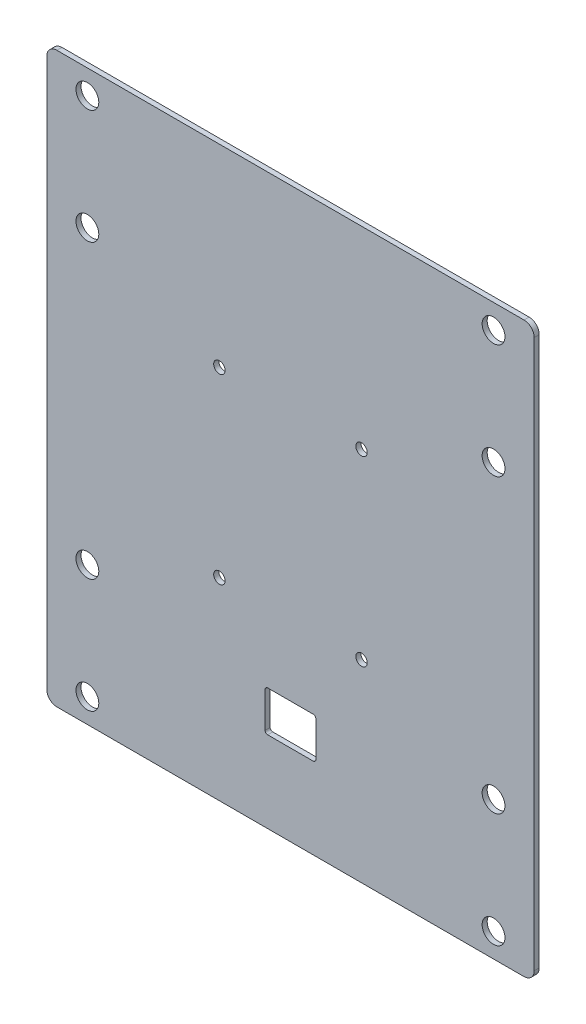
ISO-10303-21;
HEADER;
FILE_DESCRIPTION(('STEP AP214'),'2;1');
FILE_NAME('part.step','',(''),(''),'','','');
FILE_SCHEMA(('AUTOMOTIVE_DESIGN { 1 0 10303 214 1 1 1 1 }'));
ENDSEC;
DATA;
#1=APPLICATION_CONTEXT('core data for automotive mechanical design processes');
#2=APPLICATION_PROTOCOL_DEFINITION('international standard','automotive_design',2000,#1);
#3=PRODUCT_CONTEXT('',#1,'mechanical');
#4=PRODUCT('Part','Part','',(#3));
#5=PRODUCT_RELATED_PRODUCT_CATEGORY('part','',(#4));
#6=PRODUCT_DEFINITION_FORMATION('','',#4);
#7=PRODUCT_DEFINITION_CONTEXT('part definition',#1,'design');
#8=PRODUCT_DEFINITION('design','',#6,#7);
#9=PRODUCT_DEFINITION_SHAPE('','',#8);
#10=(LENGTH_UNIT() NAMED_UNIT(*) SI_UNIT(.MILLI.,.METRE.));
#11=(NAMED_UNIT(*) PLANE_ANGLE_UNIT() SI_UNIT($,.RADIAN.));
#12=(NAMED_UNIT(*) SI_UNIT($,.STERADIAN.) SOLID_ANGLE_UNIT());
#13=UNCERTAINTY_MEASURE_WITH_UNIT(LENGTH_MEASURE(1.E-05),#10,'distance_accuracy_value','');
#14=(GEOMETRIC_REPRESENTATION_CONTEXT(3) GLOBAL_UNCERTAINTY_ASSIGNED_CONTEXT((#13)) GLOBAL_UNIT_ASSIGNED_CONTEXT((#10,
#11,#12)) REPRESENTATION_CONTEXT('',''));
#15=CARTESIAN_POINT('',(0.,0.,0.));
#16=DIRECTION('',(0.,0.,1.));
#17=DIRECTION('',(1.,0.,0.));
#18=AXIS2_PLACEMENT_3D('',#15,#16,#17);
#19=CARTESIAN_POINT('',(152.4,177.8,3.175));
#20=DIRECTION('',(-1.,0.,0.));
#21=DIRECTION('',(0.,-1.,0.));
#22=AXIS2_PLACEMENT_3D('',#19,#20,#21);
#23=PLANE('',#22);
#24=DIRECTION('',(0.,1.,0.));
#25=VECTOR('',#24,1.);
#26=CARTESIAN_POINT('',(152.4,177.8,3.175));
#27=LINE('',#26,#25);
#28=CARTESIAN_POINT('',(152.4,-171.45,3.175));
#29=VERTEX_POINT('',#28);
#30=CARTESIAN_POINT('',(152.4,171.45,3.175));
#31=VERTEX_POINT('',#30);
#32=EDGE_CURVE('E165',#29,#31,#27,.T.);
#33=ORIENTED_EDGE('',*,*,#32,.F.);
#34=DIRECTION('',(0.,0.,-1.));
#35=VECTOR('',#34,1.);
#36=CARTESIAN_POINT('',(152.4,-171.45,3.175));
#37=LINE('',#36,#35);
#38=CARTESIAN_POINT('',(152.4,-171.45,0.));
#39=VERTEX_POINT('',#38);
#40=EDGE_CURVE('E150',#29,#39,#37,.T.);
#41=ORIENTED_EDGE('',*,*,#40,.T.);
#42=DIRECTION('',(0.,1.,0.));
#43=VECTOR('',#42,1.);
#44=CARTESIAN_POINT('',(152.4,177.8,0.));
#45=LINE('',#44,#43);
#46=CARTESIAN_POINT('',(152.4,171.45,0.));
#47=VERTEX_POINT('',#46);
#48=EDGE_CURVE('E162',#39,#47,#45,.T.);
#49=ORIENTED_EDGE('',*,*,#48,.T.);
#50=DIRECTION('',(0.,0.,-1.));
#51=VECTOR('',#50,1.);
#52=CARTESIAN_POINT('',(152.4,171.45,3.175));
#53=LINE('',#52,#51);
#54=EDGE_CURVE('E167',#47,#31,#53,.F.);
#55=ORIENTED_EDGE('',*,*,#54,.T.);
#56=EDGE_LOOP('',(#33,#41,#49,#55));
#57=FACE_BOUND('',#56,.T.);
#58=ADVANCED_FACE('F33',(#57),#23,.F.);
#59=CARTESIAN_POINT('',(-152.4,177.8,3.175));
#60=DIRECTION('',(0.,-1.,0.));
#61=DIRECTION('',(0.,0.,-1.));
#62=AXIS2_PLACEMENT_3D('',#59,#60,#61);
#63=PLANE('',#62);
#64=DIRECTION('',(-1.,0.,0.));
#65=VECTOR('',#64,1.);
#66=CARTESIAN_POINT('',(-152.4,177.8,3.175));
#67=LINE('',#66,#65);
#68=CARTESIAN_POINT('',(146.05,177.8,3.175));
#69=VERTEX_POINT('',#68);
#70=CARTESIAN_POINT('',(-146.05,177.8,3.175));
#71=VERTEX_POINT('',#70);
#72=EDGE_CURVE('E349',#69,#71,#67,.T.);
#73=ORIENTED_EDGE('',*,*,#72,.F.);
#74=DIRECTION('',(0.,0.,-1.));
#75=VECTOR('',#74,1.);
#76=CARTESIAN_POINT('',(146.05,177.8,3.175));
#77=LINE('',#76,#75);
#78=CARTESIAN_POINT('',(146.05,177.8,0.));
#79=VERTEX_POINT('',#78);
#80=EDGE_CURVE('E211',#69,#79,#77,.T.);
#81=ORIENTED_EDGE('',*,*,#80,.T.);
#82=DIRECTION('',(-1.,0.,0.));
#83=VECTOR('',#82,1.);
#84=CARTESIAN_POINT('',(-152.4,177.8,0.));
#85=LINE('',#84,#83);
#86=CARTESIAN_POINT('',(-146.05,177.8,0.));
#87=VERTEX_POINT('',#86);
#88=EDGE_CURVE('E172',#79,#87,#85,.T.);
#89=ORIENTED_EDGE('',*,*,#88,.T.);
#90=DIRECTION('',(0.,0.,-1.));
#91=VECTOR('',#90,1.);
#92=CARTESIAN_POINT('',(-146.05,177.8,3.175));
#93=LINE('',#92,#91);
#94=EDGE_CURVE('E209',#87,#71,#93,.F.);
#95=ORIENTED_EDGE('',*,*,#94,.T.);
#96=EDGE_LOOP('',(#73,#81,#89,#95));
#97=FACE_BOUND('',#96,.T.);
#98=ADVANCED_FACE('F374',(#97),#63,.F.);
#99=CARTESIAN_POINT('',(-152.4,177.8,3.175));
#100=DIRECTION('',(1.,0.,0.));
#101=DIRECTION('',(0.,1.,0.));
#102=AXIS2_PLACEMENT_3D('',#99,#100,#101);
#103=PLANE('',#102);
#104=DIRECTION('',(0.,-1.,0.));
#105=VECTOR('',#104,1.);
#106=CARTESIAN_POINT('',(-152.4,177.8,0.));
#107=LINE('',#106,#105);
#108=CARTESIAN_POINT('',(-152.4,171.45,0.));
#109=VERTEX_POINT('',#108);
#110=CARTESIAN_POINT('',(-152.4,-171.45,0.));
#111=VERTEX_POINT('',#110);
#112=EDGE_CURVE('E176',#109,#111,#107,.T.);
#113=ORIENTED_EDGE('',*,*,#112,.T.);
#114=DIRECTION('',(0.,0.,-1.));
#115=VECTOR('',#114,1.);
#116=CARTESIAN_POINT('',(-152.4,-171.45,3.175));
#117=LINE('',#116,#115);
#118=CARTESIAN_POINT('',(-152.4,-171.45,3.175));
#119=VERTEX_POINT('',#118);
#120=EDGE_CURVE('E207',#111,#119,#117,.F.);
#121=ORIENTED_EDGE('',*,*,#120,.T.);
#122=DIRECTION('',(0.,-1.,0.));
#123=VECTOR('',#122,1.);
#124=CARTESIAN_POINT('',(-152.4,177.8,3.175));
#125=LINE('',#124,#123);
#126=CARTESIAN_POINT('',(-152.4,171.45,3.175));
#127=VERTEX_POINT('',#126);
#128=EDGE_CURVE('E351',#127,#119,#125,.T.);
#129=ORIENTED_EDGE('',*,*,#128,.F.);
#130=DIRECTION('',(0.,0.,-1.));
#131=VECTOR('',#130,1.);
#132=CARTESIAN_POINT('',(-152.4,171.45,3.175));
#133=LINE('',#132,#131);
#134=EDGE_CURVE('E204',#127,#109,#133,.T.);
#135=ORIENTED_EDGE('',*,*,#134,.T.);
#136=EDGE_LOOP('',(#113,#121,#129,#135));
#137=FACE_BOUND('',#136,.T.);
#138=ADVANCED_FACE('F366',(#137),#103,.F.);
#139=CARTESIAN_POINT('',(-152.4,-177.8,3.175));
#140=DIRECTION('',(0.,1.,0.));
#141=DIRECTION('',(0.,0.,1.));
#142=AXIS2_PLACEMENT_3D('',#139,#140,#141);
#143=PLANE('',#142);
#144=DIRECTION('',(1.,0.,0.));
#145=VECTOR('',#144,1.);
#146=CARTESIAN_POINT('',(-152.4,-177.8,0.));
#147=LINE('',#146,#145);
#148=CARTESIAN_POINT('',(-146.05,-177.8,0.));
#149=VERTEX_POINT('',#148);
#150=CARTESIAN_POINT('',(146.05,-177.8,0.));
#151=VERTEX_POINT('',#150);
#152=EDGE_CURVE('E187',#149,#151,#147,.T.);
#153=ORIENTED_EDGE('',*,*,#152,.T.);
#154=DIRECTION('',(0.,0.,-1.));
#155=VECTOR('',#154,1.);
#156=CARTESIAN_POINT('',(146.05,-177.8,3.175));
#157=LINE('',#156,#155);
#158=CARTESIAN_POINT('',(146.05,-177.8,3.175));
#159=VERTEX_POINT('',#158);
#160=EDGE_CURVE('E151',#151,#159,#157,.F.);
#161=ORIENTED_EDGE('',*,*,#160,.T.);
#162=DIRECTION('',(1.,0.,0.));
#163=VECTOR('',#162,1.);
#164=CARTESIAN_POINT('',(-152.4,-177.8,3.175));
#165=LINE('',#164,#163);
#166=CARTESIAN_POINT('',(-146.05,-177.8,3.175));
#167=VERTEX_POINT('',#166);
#168=EDGE_CURVE('E182',#167,#159,#165,.T.);
#169=ORIENTED_EDGE('',*,*,#168,.F.);
#170=DIRECTION('',(0.,0.,-1.));
#171=VECTOR('',#170,1.);
#172=CARTESIAN_POINT('',(-146.05,-177.8,3.175));
#173=LINE('',#172,#171);
#174=EDGE_CURVE('E156',#167,#149,#173,.T.);
#175=ORIENTED_EDGE('',*,*,#174,.T.);
#176=EDGE_LOOP('',(#153,#161,#169,#175));
#177=FACE_BOUND('',#176,.T.);
#178=ADVANCED_FACE('F360',(#177),#143,.F.);
#179=CARTESIAN_POINT('',(0.,0.,3.175));
#180=DIRECTION('',(0.,0.,1.));
#181=DIRECTION('',(1.,0.,0.));
#182=AXIS2_PLACEMENT_3D('',#179,#180,#181);
#183=PLANE('',#182);
#184=DIRECTION('',(-1.,0.,0.));
#185=VECTOR('',#184,1.);
#186=CARTESIAN_POINT('',(0.,-101.6,3.175));
#187=LINE('',#186,#185);
#188=CARTESIAN_POINT('',(14.2875,-101.6,3.175));
#189=VERTEX_POINT('',#188);
#190=CARTESIAN_POINT('',(-14.2875,-101.6,3.175));
#191=VERTEX_POINT('',#190);
#192=EDGE_CURVE('E251',#189,#191,#187,.T.);
#193=ORIENTED_EDGE('',*,*,#192,.F.);
#194=CARTESIAN_POINT('',(14.2875,-103.1875,3.175));
#195=DIRECTION('',(0.,0.,1.));
#196=DIRECTION('',(1.,0.,0.));
#197=AXIS2_PLACEMENT_3D('',#194,#195,#196);
#198=CIRCLE('',#197,1.5875);
#199=CARTESIAN_POINT('',(15.875,-103.1875,3.175));
#200=VERTEX_POINT('',#199);
#201=EDGE_CURVE('E41',#189,#200,#198,.F.);
#202=ORIENTED_EDGE('',*,*,#201,.T.);
#203=DIRECTION('',(0.,-1.,0.));
#204=VECTOR('',#203,1.);
#205=CARTESIAN_POINT('',(15.8750000000001,0.,3.175));
#206=LINE('',#205,#204);
#207=CARTESIAN_POINT('',(15.875,-125.4125,3.175));
#208=VERTEX_POINT('',#207);
#209=EDGE_CURVE('E250',#200,#208,#206,.T.);
#210=ORIENTED_EDGE('',*,*,#209,.T.);
#211=CARTESIAN_POINT('',(14.2875,-125.4125,3.175));
#212=DIRECTION('',(0.,0.,1.));
#213=DIRECTION('',(1.,0.,0.));
#214=AXIS2_PLACEMENT_3D('',#211,#212,#213);
#215=CIRCLE('',#214,1.5875);
#216=CARTESIAN_POINT('',(14.2875,-127.,3.175));
#217=VERTEX_POINT('',#216);
#218=EDGE_CURVE('E233',#208,#217,#215,.F.);
#219=ORIENTED_EDGE('',*,*,#218,.T.);
#220=DIRECTION('',(-1.,0.,0.));
#221=VECTOR('',#220,1.);
#222=CARTESIAN_POINT('',(0.,-127.,3.175));
#223=LINE('',#222,#221);
#224=CARTESIAN_POINT('',(-14.2875,-127.,3.175));
#225=VERTEX_POINT('',#224);
#226=EDGE_CURVE('E260',#217,#225,#223,.T.);
#227=ORIENTED_EDGE('',*,*,#226,.T.);
#228=CARTESIAN_POINT('',(-14.2875,-125.4125,3.175));
#229=DIRECTION('',(0.,0.,1.));
#230=DIRECTION('',(1.,0.,0.));
#231=AXIS2_PLACEMENT_3D('',#228,#229,#230);
#232=CIRCLE('',#231,1.5875);
#233=CARTESIAN_POINT('',(-15.875,-125.4125,3.175));
#234=VERTEX_POINT('',#233);
#235=EDGE_CURVE('E237',#225,#234,#232,.F.);
#236=ORIENTED_EDGE('',*,*,#235,.T.);
#237=DIRECTION('',(0.,-1.,0.));
#238=VECTOR('',#237,1.);
#239=CARTESIAN_POINT('',(-15.875,0.,3.175));
#240=LINE('',#239,#238);
#241=CARTESIAN_POINT('',(-15.875,-103.1875,3.175));
#242=VERTEX_POINT('',#241);
#243=EDGE_CURVE('E276',#242,#234,#240,.T.);
#244=ORIENTED_EDGE('',*,*,#243,.F.);
#245=CARTESIAN_POINT('',(-14.2875,-103.1875,3.175));
#246=DIRECTION('',(0.,0.,1.));
#247=DIRECTION('',(1.,0.,0.));
#248=AXIS2_PLACEMENT_3D('',#245,#246,#247);
#249=CIRCLE('',#248,1.5875);
#250=EDGE_CURVE('E241',#242,#191,#249,.F.);
#251=ORIENTED_EDGE('',*,*,#250,.T.);
#252=EDGE_LOOP('',(#193,#202,#210,#219,#227,#236,#244,#251));
#253=FACE_BOUND('',#252,.T.);
#254=CARTESIAN_POINT('',(44.4499999999999,56.9515624999999,3.175));
#255=DIRECTION('',(0.,0.,-1.));
#256=DIRECTION('',(-1.,0.,0.));
#257=AXIS2_PLACEMENT_3D('',#254,#255,#256);
#258=CIRCLE('',#257,3.57124);
#259=CARTESIAN_POINT('',(40.8787599999999,56.9515624999999,3.175));
#260=VERTEX_POINT('',#259);
#261=EDGE_CURVE('E283',#260,#260,#258,.T.);
#262=ORIENTED_EDGE('',*,*,#261,.T.);
#263=EDGE_LOOP('',(#262));
#264=FACE_BOUND('',#263,.T.);
#265=CARTESIAN_POINT('',(44.4499999999999,-56.9515624999999,3.175));
#266=DIRECTION('',(0.,0.,-1.));
#267=DIRECTION('',(-1.,0.,0.));
#268=AXIS2_PLACEMENT_3D('',#265,#266,#267);
#269=CIRCLE('',#268,3.57124);
#270=CARTESIAN_POINT('',(40.8787599999999,-56.9515624999999,3.175));
#271=VERTEX_POINT('',#270);
#272=EDGE_CURVE('E289',#271,#271,#269,.T.);
#273=ORIENTED_EDGE('',*,*,#272,.T.);
#274=EDGE_LOOP('',(#273));
#275=FACE_BOUND('',#274,.T.);
#276=CARTESIAN_POINT('',(-44.4500000000001,56.9515624999999,3.175));
#277=DIRECTION('',(0.,0.,-1.));
#278=DIRECTION('',(-1.,0.,0.));
#279=AXIS2_PLACEMENT_3D('',#276,#277,#278);
#280=CIRCLE('',#279,3.57124);
#281=CARTESIAN_POINT('',(-48.0212400000001,56.9515624999999,3.175));
#282=VERTEX_POINT('',#281);
#283=EDGE_CURVE('E295',#282,#282,#280,.T.);
#284=ORIENTED_EDGE('',*,*,#283,.T.);
#285=EDGE_LOOP('',(#284));
#286=FACE_BOUND('',#285,.T.);
#287=CARTESIAN_POINT('',(-44.4500000000001,-56.9515624999999,3.175));
#288=DIRECTION('',(0.,0.,-1.));
#289=DIRECTION('',(-1.,0.,0.));
#290=AXIS2_PLACEMENT_3D('',#287,#288,#289);
#291=CIRCLE('',#290,3.57124);
#292=CARTESIAN_POINT('',(-48.0212400000001,-56.9515624999999,3.175));
#293=VERTEX_POINT('',#292);
#294=EDGE_CURVE('E301',#293,#293,#291,.T.);
#295=ORIENTED_EDGE('',*,*,#294,.T.);
#296=EDGE_LOOP('',(#295));
#297=FACE_BOUND('',#296,.T.);
#298=CARTESIAN_POINT('',(-127.,162.71875,3.175));
#299=DIRECTION('',(0.,0.,1.));
#300=DIRECTION('',(1.,0.,0.));
#301=AXIS2_PLACEMENT_3D('',#298,#299,#300);
#302=CIRCLE('',#301,7.14375);
#303=CARTESIAN_POINT('',(-119.85625,162.71875,3.175));
#304=VERTEX_POINT('',#303);
#305=EDGE_CURVE('E304',#304,#304,#302,.T.);
#306=ORIENTED_EDGE('',*,*,#305,.F.);
#307=EDGE_LOOP('',(#306));
#308=FACE_BOUND('',#307,.T.);
#309=CARTESIAN_POINT('',(-127.,91.2812499999997,3.175));
#310=DIRECTION('',(0.,0.,1.));
#311=DIRECTION('',(1.,0.,0.));
#312=AXIS2_PLACEMENT_3D('',#309,#310,#311);
#313=CIRCLE('',#312,7.14375);
#314=CARTESIAN_POINT('',(-119.85625,91.2812499999997,3.175));
#315=VERTEX_POINT('',#314);
#316=EDGE_CURVE('E310',#315,#315,#313,.T.);
#317=ORIENTED_EDGE('',*,*,#316,.F.);
#318=EDGE_LOOP('',(#317));
#319=FACE_BOUND('',#318,.T.);
#320=CARTESIAN_POINT('',(-127.,-91.2812500000001,3.175));
#321=DIRECTION('',(0.,0.,1.));
#322=DIRECTION('',(1.,0.,0.));
#323=AXIS2_PLACEMENT_3D('',#320,#321,#322);
#324=CIRCLE('',#323,7.14375);
#325=CARTESIAN_POINT('',(-119.85625,-91.2812500000001,3.175));
#326=VERTEX_POINT('',#325);
#327=EDGE_CURVE('E316',#326,#326,#324,.T.);
#328=ORIENTED_EDGE('',*,*,#327,.F.);
#329=EDGE_LOOP('',(#328));
#330=FACE_BOUND('',#329,.T.);
#331=CARTESIAN_POINT('',(-127.,-162.71875,3.175));
#332=DIRECTION('',(0.,0.,1.));
#333=DIRECTION('',(1.,0.,0.));
#334=AXIS2_PLACEMENT_3D('',#331,#332,#333);
#335=CIRCLE('',#334,7.14375);
#336=CARTESIAN_POINT('',(-119.85625,-162.71875,3.175));
#337=VERTEX_POINT('',#336);
#338=EDGE_CURVE('E322',#337,#337,#335,.T.);
#339=ORIENTED_EDGE('',*,*,#338,.F.);
#340=EDGE_LOOP('',(#339));
#341=FACE_BOUND('',#340,.T.);
#342=CARTESIAN_POINT('',(127.,-162.71875,3.175));
#343=DIRECTION('',(0.,0.,1.));
#344=DIRECTION('',(1.,0.,0.));
#345=AXIS2_PLACEMENT_3D('',#342,#343,#344);
#346=CIRCLE('',#345,7.14375);
#347=CARTESIAN_POINT('',(134.14375,-162.71875,3.175));
#348=VERTEX_POINT('',#347);
#349=EDGE_CURVE('E328',#348,#348,#346,.T.);
#350=ORIENTED_EDGE('',*,*,#349,.F.);
#351=EDGE_LOOP('',(#350));
#352=FACE_BOUND('',#351,.T.);
#353=CARTESIAN_POINT('',(127.,-91.28125,3.175));
#354=DIRECTION('',(0.,0.,1.));
#355=DIRECTION('',(1.,0.,0.));
#356=AXIS2_PLACEMENT_3D('',#353,#354,#355);
#357=CIRCLE('',#356,7.14375);
#358=CARTESIAN_POINT('',(134.14375,-91.28125,3.175));
#359=VERTEX_POINT('',#358);
#360=EDGE_CURVE('E334',#359,#359,#357,.T.);
#361=ORIENTED_EDGE('',*,*,#360,.F.);
#362=EDGE_LOOP('',(#361));
#363=FACE_BOUND('',#362,.T.);
#364=CARTESIAN_POINT('',(127.,91.2812499999998,3.175));
#365=DIRECTION('',(0.,0.,1.));
#366=DIRECTION('',(1.,0.,0.));
#367=AXIS2_PLACEMENT_3D('',#364,#365,#366);
#368=CIRCLE('',#367,7.14375);
#369=CARTESIAN_POINT('',(134.14375,91.2812499999998,3.175));
#370=VERTEX_POINT('',#369);
#371=EDGE_CURVE('E340',#370,#370,#368,.T.);
#372=ORIENTED_EDGE('',*,*,#371,.F.);
#373=EDGE_LOOP('',(#372));
#374=FACE_BOUND('',#373,.T.);
#375=CARTESIAN_POINT('',(127.,162.71875,3.175));
#376=DIRECTION('',(0.,0.,1.));
#377=DIRECTION('',(1.,0.,0.));
#378=AXIS2_PLACEMENT_3D('',#375,#376,#377);
#379=CIRCLE('',#378,7.14375);
#380=CARTESIAN_POINT('',(134.14375,162.71875,3.175));
#381=VERTEX_POINT('',#380);
#382=EDGE_CURVE('E179',#381,#381,#379,.T.);
#383=ORIENTED_EDGE('',*,*,#382,.F.);
#384=EDGE_LOOP('',(#383));
#385=FACE_BOUND('',#384,.T.);
#386=ORIENTED_EDGE('',*,*,#168,.T.);
#387=CARTESIAN_POINT('',(146.05,-171.45,3.175));
#388=DIRECTION('',(0.,0.,1.));
#389=DIRECTION('',(1.,0.,0.));
#390=AXIS2_PLACEMENT_3D('',#387,#388,#389);
#391=CIRCLE('',#390,6.35);
#392=EDGE_CURVE('E202',#159,#29,#391,.T.);
#393=ORIENTED_EDGE('',*,*,#392,.T.);
#394=ORIENTED_EDGE('',*,*,#32,.T.);
#395=CARTESIAN_POINT('',(146.05,171.45,3.175));
#396=DIRECTION('',(0.,0.,1.));
#397=DIRECTION('',(1.,0.,0.));
#398=AXIS2_PLACEMENT_3D('',#395,#396,#397);
#399=CIRCLE('',#398,6.35);
#400=EDGE_CURVE('E198',#31,#69,#399,.T.);
#401=ORIENTED_EDGE('',*,*,#400,.T.);
#402=ORIENTED_EDGE('',*,*,#72,.T.);
#403=CARTESIAN_POINT('',(-146.05,171.45,3.175));
#404=DIRECTION('',(0.,0.,1.));
#405=DIRECTION('',(1.,0.,0.));
#406=AXIS2_PLACEMENT_3D('',#403,#404,#405);
#407=CIRCLE('',#406,6.35);
#408=EDGE_CURVE('E196',#71,#127,#407,.T.);
#409=ORIENTED_EDGE('',*,*,#408,.T.);
#410=ORIENTED_EDGE('',*,*,#128,.T.);
#411=CARTESIAN_POINT('',(-146.05,-171.45,3.175));
#412=DIRECTION('',(0.,0.,1.));
#413=DIRECTION('',(1.,0.,0.));
#414=AXIS2_PLACEMENT_3D('',#411,#412,#413);
#415=CIRCLE('',#414,6.35);
#416=EDGE_CURVE('E200',#119,#167,#415,.T.);
#417=ORIENTED_EDGE('',*,*,#416,.T.);
#418=EDGE_LOOP('',(#386,#393,#394,#401,#402,#409,#410,#417));
#419=FACE_BOUND('',#418,.T.);
#420=ADVANCED_FACE('F248',(#253,#264,#275,#286,#297,#308,#319,#330,#341,#352,#363,#374,#385,
#419),#183,.T.);
#421=CARTESIAN_POINT('',(0.,0.,0.));
#422=DIRECTION('',(0.,0.,1.));
#423=DIRECTION('',(1.,0.,0.));
#424=AXIS2_PLACEMENT_3D('',#421,#422,#423);
#425=PLANE('',#424);
#426=DIRECTION('',(0.,-1.,0.));
#427=VECTOR('',#426,1.);
#428=CARTESIAN_POINT('',(15.8750000000001,0.,0.));
#429=LINE('',#428,#427);
#430=CARTESIAN_POINT('',(15.875,-103.1875,0.));
#431=VERTEX_POINT('',#430);
#432=CARTESIAN_POINT('',(15.875,-125.4125,0.));
#433=VERTEX_POINT('',#432);
#434=EDGE_CURVE('E272',#431,#433,#429,.T.);
#435=ORIENTED_EDGE('',*,*,#434,.F.);
#436=CARTESIAN_POINT('',(14.2875,-103.1875,0.));
#437=DIRECTION('',(0.,0.,1.));
#438=DIRECTION('',(1.,0.,0.));
#439=AXIS2_PLACEMENT_3D('',#436,#437,#438);
#440=CIRCLE('',#439,1.5875);
#441=CARTESIAN_POINT('',(14.2875,-101.6,0.));
#442=VERTEX_POINT('',#441);
#443=EDGE_CURVE('E11',#431,#442,#440,.T.);
#444=ORIENTED_EDGE('',*,*,#443,.T.);
#445=DIRECTION('',(-1.,0.,0.));
#446=VECTOR('',#445,1.);
#447=CARTESIAN_POINT('',(0.,-101.6,0.));
#448=LINE('',#447,#446);
#449=CARTESIAN_POINT('',(-14.2875,-101.6,0.));
#450=VERTEX_POINT('',#449);
#451=EDGE_CURVE('E259',#442,#450,#448,.T.);
#452=ORIENTED_EDGE('',*,*,#451,.T.);
#453=CARTESIAN_POINT('',(-14.2875,-103.1875,0.));
#454=DIRECTION('',(0.,0.,1.));
#455=DIRECTION('',(1.,0.,0.));
#456=AXIS2_PLACEMENT_3D('',#453,#454,#455);
#457=CIRCLE('',#456,1.5875);
#458=CARTESIAN_POINT('',(-15.875,-103.1875,0.));
#459=VERTEX_POINT('',#458);
#460=EDGE_CURVE('E243',#450,#459,#457,.T.);
#461=ORIENTED_EDGE('',*,*,#460,.T.);
#462=DIRECTION('',(0.,-1.,0.));
#463=VECTOR('',#462,1.);
#464=CARTESIAN_POINT('',(-15.875,0.,0.));
#465=LINE('',#464,#463);
#466=CARTESIAN_POINT('',(-15.875,-125.4125,0.));
#467=VERTEX_POINT('',#466);
#468=EDGE_CURVE('E264',#459,#467,#465,.T.);
#469=ORIENTED_EDGE('',*,*,#468,.T.);
#470=CARTESIAN_POINT('',(-14.2875,-125.4125,0.));
#471=DIRECTION('',(0.,0.,1.));
#472=DIRECTION('',(1.,0.,0.));
#473=AXIS2_PLACEMENT_3D('',#470,#471,#472);
#474=CIRCLE('',#473,1.5875);
#475=CARTESIAN_POINT('',(-14.2875,-127.,0.));
#476=VERTEX_POINT('',#475);
#477=EDGE_CURVE('E239',#467,#476,#474,.T.);
#478=ORIENTED_EDGE('',*,*,#477,.T.);
#479=DIRECTION('',(-1.,0.,0.));
#480=VECTOR('',#479,1.);
#481=CARTESIAN_POINT('',(0.,-127.,0.));
#482=LINE('',#481,#480);
#483=CARTESIAN_POINT('',(14.2875,-127.,0.));
#484=VERTEX_POINT('',#483);
#485=EDGE_CURVE('E267',#484,#476,#482,.T.);
#486=ORIENTED_EDGE('',*,*,#485,.F.);
#487=CARTESIAN_POINT('',(14.2875,-125.4125,0.));
#488=DIRECTION('',(0.,0.,1.));
#489=DIRECTION('',(1.,0.,0.));
#490=AXIS2_PLACEMENT_3D('',#487,#488,#489);
#491=CIRCLE('',#490,1.5875);
#492=EDGE_CURVE('E235',#484,#433,#491,.T.);
#493=ORIENTED_EDGE('',*,*,#492,.T.);
#494=EDGE_LOOP('',(#435,#444,#452,#461,#469,#478,#486,#493));
#495=FACE_BOUND('',#494,.T.);
#496=CARTESIAN_POINT('',(44.4499999999999,56.9515624999999,0.));
#497=DIRECTION('',(0.,0.,-1.));
#498=DIRECTION('',(-1.,0.,0.));
#499=AXIS2_PLACEMENT_3D('',#496,#497,#498);
#500=CIRCLE('',#499,3.57124);
#501=CARTESIAN_POINT('',(40.8787599999999,56.9515624999999,0.));
#502=VERTEX_POINT('',#501);
#503=EDGE_CURVE('E274',#502,#502,#500,.T.);
#504=ORIENTED_EDGE('',*,*,#503,.F.);
#505=EDGE_LOOP('',(#504));
#506=FACE_BOUND('',#505,.T.);
#507=CARTESIAN_POINT('',(44.4499999999999,-56.9515624999999,0.));
#508=DIRECTION('',(0.,0.,-1.));
#509=DIRECTION('',(-1.,0.,0.));
#510=AXIS2_PLACEMENT_3D('',#507,#508,#509);
#511=CIRCLE('',#510,3.57124);
#512=CARTESIAN_POINT('',(40.8787599999999,-56.9515624999999,0.));
#513=VERTEX_POINT('',#512);
#514=EDGE_CURVE('E286',#513,#513,#511,.T.);
#515=ORIENTED_EDGE('',*,*,#514,.F.);
#516=EDGE_LOOP('',(#515));
#517=FACE_BOUND('',#516,.T.);
#518=CARTESIAN_POINT('',(-44.4500000000001,56.9515624999999,0.));
#519=DIRECTION('',(0.,0.,-1.));
#520=DIRECTION('',(-1.,0.,0.));
#521=AXIS2_PLACEMENT_3D('',#518,#519,#520);
#522=CIRCLE('',#521,3.57124);
#523=CARTESIAN_POINT('',(-48.0212400000001,56.9515624999999,0.));
#524=VERTEX_POINT('',#523);
#525=EDGE_CURVE('E292',#524,#524,#522,.T.);
#526=ORIENTED_EDGE('',*,*,#525,.F.);
#527=EDGE_LOOP('',(#526));
#528=FACE_BOUND('',#527,.T.);
#529=CARTESIAN_POINT('',(-44.4500000000001,-56.9515624999999,0.));
#530=DIRECTION('',(0.,0.,-1.));
#531=DIRECTION('',(-1.,0.,0.));
#532=AXIS2_PLACEMENT_3D('',#529,#530,#531);
#533=CIRCLE('',#532,3.57124);
#534=CARTESIAN_POINT('',(-48.0212400000001,-56.9515624999999,0.));
#535=VERTEX_POINT('',#534);
#536=EDGE_CURVE('E298',#535,#535,#533,.T.);
#537=ORIENTED_EDGE('',*,*,#536,.F.);
#538=EDGE_LOOP('',(#537));
#539=FACE_BOUND('',#538,.T.);
#540=CARTESIAN_POINT('',(-127.,162.71875,0.));
#541=DIRECTION('',(0.,0.,1.));
#542=DIRECTION('',(1.,0.,0.));
#543=AXIS2_PLACEMENT_3D('',#540,#541,#542);
#544=CIRCLE('',#543,7.14375);
#545=CARTESIAN_POINT('',(-119.85625,162.71875,0.));
#546=VERTEX_POINT('',#545);
#547=EDGE_CURVE('E307',#546,#546,#544,.T.);
#548=ORIENTED_EDGE('',*,*,#547,.T.);
#549=EDGE_LOOP('',(#548));
#550=FACE_BOUND('',#549,.T.);
#551=CARTESIAN_POINT('',(-127.,91.2812499999997,0.));
#552=DIRECTION('',(0.,0.,1.));
#553=DIRECTION('',(1.,0.,0.));
#554=AXIS2_PLACEMENT_3D('',#551,#552,#553);
#555=CIRCLE('',#554,7.14375);
#556=CARTESIAN_POINT('',(-119.85625,91.2812499999997,0.));
#557=VERTEX_POINT('',#556);
#558=EDGE_CURVE('E313',#557,#557,#555,.T.);
#559=ORIENTED_EDGE('',*,*,#558,.T.);
#560=EDGE_LOOP('',(#559));
#561=FACE_BOUND('',#560,.T.);
#562=CARTESIAN_POINT('',(-127.,-91.2812500000001,0.));
#563=DIRECTION('',(0.,0.,1.));
#564=DIRECTION('',(1.,0.,0.));
#565=AXIS2_PLACEMENT_3D('',#562,#563,#564);
#566=CIRCLE('',#565,7.14375);
#567=CARTESIAN_POINT('',(-119.85625,-91.2812500000001,0.));
#568=VERTEX_POINT('',#567);
#569=EDGE_CURVE('E319',#568,#568,#566,.T.);
#570=ORIENTED_EDGE('',*,*,#569,.T.);
#571=EDGE_LOOP('',(#570));
#572=FACE_BOUND('',#571,.T.);
#573=CARTESIAN_POINT('',(-127.,-162.71875,0.));
#574=DIRECTION('',(0.,0.,1.));
#575=DIRECTION('',(1.,0.,0.));
#576=AXIS2_PLACEMENT_3D('',#573,#574,#575);
#577=CIRCLE('',#576,7.14375);
#578=CARTESIAN_POINT('',(-119.85625,-162.71875,0.));
#579=VERTEX_POINT('',#578);
#580=EDGE_CURVE('E325',#579,#579,#577,.T.);
#581=ORIENTED_EDGE('',*,*,#580,.T.);
#582=EDGE_LOOP('',(#581));
#583=FACE_BOUND('',#582,.T.);
#584=CARTESIAN_POINT('',(127.,-162.71875,0.));
#585=DIRECTION('',(0.,0.,1.));
#586=DIRECTION('',(1.,0.,0.));
#587=AXIS2_PLACEMENT_3D('',#584,#585,#586);
#588=CIRCLE('',#587,7.14375);
#589=CARTESIAN_POINT('',(134.14375,-162.71875,0.));
#590=VERTEX_POINT('',#589);
#591=EDGE_CURVE('E331',#590,#590,#588,.T.);
#592=ORIENTED_EDGE('',*,*,#591,.T.);
#593=EDGE_LOOP('',(#592));
#594=FACE_BOUND('',#593,.T.);
#595=CARTESIAN_POINT('',(127.,-91.28125,0.));
#596=DIRECTION('',(0.,0.,1.));
#597=DIRECTION('',(1.,0.,0.));
#598=AXIS2_PLACEMENT_3D('',#595,#596,#597);
#599=CIRCLE('',#598,7.14375);
#600=CARTESIAN_POINT('',(134.14375,-91.28125,0.));
#601=VERTEX_POINT('',#600);
#602=EDGE_CURVE('E337',#601,#601,#599,.T.);
#603=ORIENTED_EDGE('',*,*,#602,.T.);
#604=EDGE_LOOP('',(#603));
#605=FACE_BOUND('',#604,.T.);
#606=CARTESIAN_POINT('',(127.,91.2812499999998,0.));
#607=DIRECTION('',(0.,0.,1.));
#608=DIRECTION('',(1.,0.,0.));
#609=AXIS2_PLACEMENT_3D('',#606,#607,#608);
#610=CIRCLE('',#609,7.14375);
#611=CARTESIAN_POINT('',(134.14375,91.2812499999998,0.));
#612=VERTEX_POINT('',#611);
#613=EDGE_CURVE('E343',#612,#612,#610,.T.);
#614=ORIENTED_EDGE('',*,*,#613,.T.);
#615=EDGE_LOOP('',(#614));
#616=FACE_BOUND('',#615,.T.);
#617=CARTESIAN_POINT('',(127.,162.71875,0.));
#618=DIRECTION('',(0.,0.,1.));
#619=DIRECTION('',(1.,0.,0.));
#620=AXIS2_PLACEMENT_3D('',#617,#618,#619);
#621=CIRCLE('',#620,7.14375);
#622=CARTESIAN_POINT('',(134.14375,162.71875,0.));
#623=VERTEX_POINT('',#622);
#624=EDGE_CURVE('E173',#623,#623,#621,.T.);
#625=ORIENTED_EDGE('',*,*,#624,.T.);
#626=EDGE_LOOP('',(#625));
#627=FACE_BOUND('',#626,.T.);
#628=ORIENTED_EDGE('',*,*,#48,.F.);
#629=CARTESIAN_POINT('',(146.05,-171.45,0.));
#630=DIRECTION('',(0.,0.,1.));
#631=DIRECTION('',(1.,0.,0.));
#632=AXIS2_PLACEMENT_3D('',#629,#630,#631);
#633=CIRCLE('',#632,6.35);
#634=EDGE_CURVE('E146',#39,#151,#633,.F.);
#635=ORIENTED_EDGE('',*,*,#634,.T.);
#636=ORIENTED_EDGE('',*,*,#152,.F.);
#637=CARTESIAN_POINT('',(-146.05,-171.45,0.));
#638=DIRECTION('',(0.,0.,1.));
#639=DIRECTION('',(1.,0.,0.));
#640=AXIS2_PLACEMENT_3D('',#637,#638,#639);
#641=CIRCLE('',#640,6.35);
#642=EDGE_CURVE('E157',#149,#111,#641,.F.);
#643=ORIENTED_EDGE('',*,*,#642,.T.);
#644=ORIENTED_EDGE('',*,*,#112,.F.);
#645=CARTESIAN_POINT('',(-146.05,171.45,0.));
#646=DIRECTION('',(0.,0.,1.));
#647=DIRECTION('',(1.,0.,0.));
#648=AXIS2_PLACEMENT_3D('',#645,#646,#647);
#649=CIRCLE('',#648,6.35);
#650=EDGE_CURVE('E166',#109,#87,#649,.F.);
#651=ORIENTED_EDGE('',*,*,#650,.T.);
#652=ORIENTED_EDGE('',*,*,#88,.F.);
#653=CARTESIAN_POINT('',(146.05,171.45,0.));
#654=DIRECTION('',(0.,0.,1.));
#655=DIRECTION('',(1.,0.,0.));
#656=AXIS2_PLACEMENT_3D('',#653,#654,#655);
#657=CIRCLE('',#656,6.35);
#658=EDGE_CURVE('E171',#79,#47,#657,.F.);
#659=ORIENTED_EDGE('',*,*,#658,.T.);
#660=EDGE_LOOP('',(#628,#635,#636,#643,#644,#651,#652,#659));
#661=FACE_BOUND('',#660,.T.);
#662=ADVANCED_FACE('F169',(#495,#506,#517,#528,#539,#550,#561,#572,#583,#594,#605,#616,#627,
#661),#425,.F.);
#663=CARTESIAN_POINT('',(127.,162.71875,3.175));
#664=DIRECTION('',(0.,0.,1.));
#665=DIRECTION('',(1.,0.,0.));
#666=AXIS2_PLACEMENT_3D('',#663,#664,#665);
#667=CYLINDRICAL_SURFACE('',#666,7.14375);
#668=ORIENTED_EDGE('',*,*,#624,.F.);
#669=EDGE_LOOP('',(#668));
#670=FACE_BOUND('',#669,.T.);
#671=ORIENTED_EDGE('',*,*,#382,.T.);
#672=EDGE_LOOP('',(#671));
#673=FACE_BOUND('',#672,.T.);
#674=ADVANCED_FACE('F433',(#670,#673),#667,.F.);
#675=CARTESIAN_POINT('',(127.,91.2812499999998,3.175));
#676=DIRECTION('',(0.,0.,1.));
#677=DIRECTION('',(1.,0.,0.));
#678=AXIS2_PLACEMENT_3D('',#675,#676,#677);
#679=CYLINDRICAL_SURFACE('',#678,7.14375);
#680=ORIENTED_EDGE('',*,*,#613,.F.);
#681=EDGE_LOOP('',(#680));
#682=FACE_BOUND('',#681,.T.);
#683=ORIENTED_EDGE('',*,*,#371,.T.);
#684=EDGE_LOOP('',(#683));
#685=FACE_BOUND('',#684,.T.);
#686=ADVANCED_FACE('F429',(#682,#685),#679,.F.);
#687=CARTESIAN_POINT('',(127.,-91.28125,3.175));
#688=DIRECTION('',(0.,0.,1.));
#689=DIRECTION('',(1.,0.,0.));
#690=AXIS2_PLACEMENT_3D('',#687,#688,#689);
#691=CYLINDRICAL_SURFACE('',#690,7.14375);
#692=ORIENTED_EDGE('',*,*,#602,.F.);
#693=EDGE_LOOP('',(#692));
#694=FACE_BOUND('',#693,.T.);
#695=ORIENTED_EDGE('',*,*,#360,.T.);
#696=EDGE_LOOP('',(#695));
#697=FACE_BOUND('',#696,.T.);
#698=ADVANCED_FACE('F425',(#694,#697),#691,.F.);
#699=CARTESIAN_POINT('',(127.,-162.71875,3.175));
#700=DIRECTION('',(0.,0.,1.));
#701=DIRECTION('',(1.,0.,0.));
#702=AXIS2_PLACEMENT_3D('',#699,#700,#701);
#703=CYLINDRICAL_SURFACE('',#702,7.14375);
#704=ORIENTED_EDGE('',*,*,#591,.F.);
#705=EDGE_LOOP('',(#704));
#706=FACE_BOUND('',#705,.T.);
#707=ORIENTED_EDGE('',*,*,#349,.T.);
#708=EDGE_LOOP('',(#707));
#709=FACE_BOUND('',#708,.T.);
#710=ADVANCED_FACE('F421',(#706,#709),#703,.F.);
#711=CARTESIAN_POINT('',(-127.,-162.71875,3.175));
#712=DIRECTION('',(0.,0.,1.));
#713=DIRECTION('',(1.,0.,0.));
#714=AXIS2_PLACEMENT_3D('',#711,#712,#713);
#715=CYLINDRICAL_SURFACE('',#714,7.14375);
#716=ORIENTED_EDGE('',*,*,#580,.F.);
#717=EDGE_LOOP('',(#716));
#718=FACE_BOUND('',#717,.T.);
#719=ORIENTED_EDGE('',*,*,#338,.T.);
#720=EDGE_LOOP('',(#719));
#721=FACE_BOUND('',#720,.T.);
#722=ADVANCED_FACE('F417',(#718,#721),#715,.F.);
#723=CARTESIAN_POINT('',(-127.,-91.2812500000001,3.175));
#724=DIRECTION('',(0.,0.,1.));
#725=DIRECTION('',(1.,0.,0.));
#726=AXIS2_PLACEMENT_3D('',#723,#724,#725);
#727=CYLINDRICAL_SURFACE('',#726,7.14375);
#728=ORIENTED_EDGE('',*,*,#569,.F.);
#729=EDGE_LOOP('',(#728));
#730=FACE_BOUND('',#729,.T.);
#731=ORIENTED_EDGE('',*,*,#327,.T.);
#732=EDGE_LOOP('',(#731));
#733=FACE_BOUND('',#732,.T.);
#734=ADVANCED_FACE('F407',(#730,#733),#727,.F.);
#735=CARTESIAN_POINT('',(-127.,91.2812499999997,3.175));
#736=DIRECTION('',(0.,0.,1.));
#737=DIRECTION('',(1.,0.,0.));
#738=AXIS2_PLACEMENT_3D('',#735,#736,#737);
#739=CYLINDRICAL_SURFACE('',#738,7.14375);
#740=ORIENTED_EDGE('',*,*,#558,.F.);
#741=EDGE_LOOP('',(#740));
#742=FACE_BOUND('',#741,.T.);
#743=ORIENTED_EDGE('',*,*,#316,.T.);
#744=EDGE_LOOP('',(#743));
#745=FACE_BOUND('',#744,.T.);
#746=ADVANCED_FACE('F401',(#742,#745),#739,.F.);
#747=CARTESIAN_POINT('',(-127.,162.71875,3.175));
#748=DIRECTION('',(0.,0.,1.));
#749=DIRECTION('',(1.,0.,0.));
#750=AXIS2_PLACEMENT_3D('',#747,#748,#749);
#751=CYLINDRICAL_SURFACE('',#750,7.14375);
#752=ORIENTED_EDGE('',*,*,#547,.F.);
#753=EDGE_LOOP('',(#752));
#754=FACE_BOUND('',#753,.T.);
#755=ORIENTED_EDGE('',*,*,#305,.T.);
#756=EDGE_LOOP('',(#755));
#757=FACE_BOUND('',#756,.T.);
#758=ADVANCED_FACE('F397',(#754,#757),#751,.F.);
#759=CARTESIAN_POINT('',(146.05,-171.45,3.175));
#760=DIRECTION('',(0.,0.,-1.));
#761=DIRECTION('',(-1.,0.,0.));
#762=AXIS2_PLACEMENT_3D('',#759,#760,#761);
#763=CYLINDRICAL_SURFACE('',#762,6.35);
#764=ORIENTED_EDGE('',*,*,#392,.F.);
#765=ORIENTED_EDGE('',*,*,#160,.F.);
#766=ORIENTED_EDGE('',*,*,#634,.F.);
#767=ORIENTED_EDGE('',*,*,#40,.F.);
#768=EDGE_LOOP('',(#764,#765,#766,#767));
#769=FACE_BOUND('',#768,.T.);
#770=ADVANCED_FACE('F149',(#769),#763,.T.);
#771=CARTESIAN_POINT('',(-146.05,-171.45,3.175));
#772=DIRECTION('',(0.,0.,-1.));
#773=DIRECTION('',(-1.,0.,0.));
#774=AXIS2_PLACEMENT_3D('',#771,#772,#773);
#775=CYLINDRICAL_SURFACE('',#774,6.35);
#776=ORIENTED_EDGE('',*,*,#416,.F.);
#777=ORIENTED_EDGE('',*,*,#120,.F.);
#778=ORIENTED_EDGE('',*,*,#642,.F.);
#779=ORIENTED_EDGE('',*,*,#174,.F.);
#780=EDGE_LOOP('',(#776,#777,#778,#779));
#781=FACE_BOUND('',#780,.T.);
#782=ADVANCED_FACE('F362',(#781),#775,.T.);
#783=CARTESIAN_POINT('',(146.05,171.45,3.175));
#784=DIRECTION('',(0.,0.,-1.));
#785=DIRECTION('',(-1.,0.,0.));
#786=AXIS2_PLACEMENT_3D('',#783,#784,#785);
#787=CYLINDRICAL_SURFACE('',#786,6.35);
#788=ORIENTED_EDGE('',*,*,#400,.F.);
#789=ORIENTED_EDGE('',*,*,#54,.F.);
#790=ORIENTED_EDGE('',*,*,#658,.F.);
#791=ORIENTED_EDGE('',*,*,#80,.F.);
#792=EDGE_LOOP('',(#788,#789,#790,#791));
#793=FACE_BOUND('',#792,.T.);
#794=ADVANCED_FACE('F378',(#793),#787,.T.);
#795=CARTESIAN_POINT('',(-146.05,171.45,3.175));
#796=DIRECTION('',(0.,0.,-1.));
#797=DIRECTION('',(-1.,0.,0.));
#798=AXIS2_PLACEMENT_3D('',#795,#796,#797);
#799=CYLINDRICAL_SURFACE('',#798,6.35);
#800=ORIENTED_EDGE('',*,*,#408,.F.);
#801=ORIENTED_EDGE('',*,*,#94,.F.);
#802=ORIENTED_EDGE('',*,*,#650,.F.);
#803=ORIENTED_EDGE('',*,*,#134,.F.);
#804=EDGE_LOOP('',(#800,#801,#802,#803));
#805=FACE_BOUND('',#804,.T.);
#806=ADVANCED_FACE('F370',(#805),#799,.T.);
#807=CARTESIAN_POINT('',(-44.4500000000001,-56.9515624999999,0.));
#808=DIRECTION('',(0.,0.,-1.));
#809=DIRECTION('',(-1.,0.,0.));
#810=AXIS2_PLACEMENT_3D('',#807,#808,#809);
#811=CYLINDRICAL_SURFACE('',#810,3.57124);
#812=ORIENTED_EDGE('',*,*,#294,.F.);
#813=EDGE_LOOP('',(#812));
#814=FACE_BOUND('',#813,.T.);
#815=ORIENTED_EDGE('',*,*,#536,.T.);
#816=EDGE_LOOP('',(#815));
#817=FACE_BOUND('',#816,.T.);
#818=ADVANCED_FACE('F385',(#814,#817),#811,.F.);
#819=CARTESIAN_POINT('',(-44.4500000000001,56.9515624999999,0.));
#820=DIRECTION('',(0.,0.,-1.));
#821=DIRECTION('',(-1.,0.,0.));
#822=AXIS2_PLACEMENT_3D('',#819,#820,#821);
#823=CYLINDRICAL_SURFACE('',#822,3.57124);
#824=ORIENTED_EDGE('',*,*,#283,.F.);
#825=EDGE_LOOP('',(#824));
#826=FACE_BOUND('',#825,.T.);
#827=ORIENTED_EDGE('',*,*,#525,.T.);
#828=EDGE_LOOP('',(#827));
#829=FACE_BOUND('',#828,.T.);
#830=ADVANCED_FACE('F550',(#826,#829),#823,.F.);
#831=CARTESIAN_POINT('',(44.4499999999999,-56.9515624999999,0.));
#832=DIRECTION('',(0.,0.,-1.));
#833=DIRECTION('',(-1.,0.,0.));
#834=AXIS2_PLACEMENT_3D('',#831,#832,#833);
#835=CYLINDRICAL_SURFACE('',#834,3.57124);
#836=ORIENTED_EDGE('',*,*,#272,.F.);
#837=EDGE_LOOP('',(#836));
#838=FACE_BOUND('',#837,.T.);
#839=ORIENTED_EDGE('',*,*,#514,.T.);
#840=EDGE_LOOP('',(#839));
#841=FACE_BOUND('',#840,.T.);
#842=ADVANCED_FACE('F558',(#838,#841),#835,.F.);
#843=CARTESIAN_POINT('',(44.4499999999999,56.9515624999999,0.));
#844=DIRECTION('',(0.,0.,-1.));
#845=DIRECTION('',(-1.,0.,0.));
#846=AXIS2_PLACEMENT_3D('',#843,#844,#845);
#847=CYLINDRICAL_SURFACE('',#846,3.57124);
#848=ORIENTED_EDGE('',*,*,#261,.F.);
#849=EDGE_LOOP('',(#848));
#850=FACE_BOUND('',#849,.T.);
#851=ORIENTED_EDGE('',*,*,#503,.T.);
#852=EDGE_LOOP('',(#851));
#853=FACE_BOUND('',#852,.T.);
#854=ADVANCED_FACE('F566',(#850,#853),#847,.F.);
#855=CARTESIAN_POINT('',(0.,-101.6,0.));
#856=DIRECTION('',(0.,1.,0.));
#857=DIRECTION('',(0.,0.,1.));
#858=AXIS2_PLACEMENT_3D('',#855,#856,#857);
#859=PLANE('',#858);
#860=ORIENTED_EDGE('',*,*,#192,.T.);
#861=DIRECTION('',(0.,0.,1.));
#862=VECTOR('',#861,1.);
#863=CARTESIAN_POINT('',(-14.2875,-101.6,0.));
#864=LINE('',#863,#862);
#865=EDGE_CURVE('E48',#191,#450,#864,.F.);
#866=ORIENTED_EDGE('',*,*,#865,.T.);
#867=ORIENTED_EDGE('',*,*,#451,.F.);
#868=DIRECTION('',(0.,0.,1.));
#869=VECTOR('',#868,1.);
#870=CARTESIAN_POINT('',(14.2875,-101.6,0.));
#871=LINE('',#870,#869);
#872=EDGE_CURVE('E229',#442,#189,#871,.T.);
#873=ORIENTED_EDGE('',*,*,#872,.T.);
#874=EDGE_LOOP('',(#860,#866,#867,#873));
#875=FACE_BOUND('',#874,.T.);
#876=ADVANCED_FACE('F262',(#875),#859,.F.);
#877=CARTESIAN_POINT('',(15.8750000000001,0.,0.));
#878=DIRECTION('',(-1.,0.,0.));
#879=DIRECTION('',(0.,-1.,0.));
#880=AXIS2_PLACEMENT_3D('',#877,#878,#879);
#881=PLANE('',#880);
#882=ORIENTED_EDGE('',*,*,#434,.T.);
#883=DIRECTION('',(0.,0.,1.));
#884=VECTOR('',#883,1.);
#885=CARTESIAN_POINT('',(15.875,-125.4125,3.175));
#886=LINE('',#885,#884);
#887=EDGE_CURVE('E216',#433,#208,#886,.T.);
#888=ORIENTED_EDGE('',*,*,#887,.T.);
#889=ORIENTED_EDGE('',*,*,#209,.F.);
#890=DIRECTION('',(0.,0.,1.));
#891=VECTOR('',#890,1.);
#892=CARTESIAN_POINT('',(15.875,-103.1875,0.));
#893=LINE('',#892,#891);
#894=EDGE_CURVE('E214',#200,#431,#893,.F.);
#895=ORIENTED_EDGE('',*,*,#894,.T.);
#896=EDGE_LOOP('',(#882,#888,#889,#895));
#897=FACE_BOUND('',#896,.T.);
#898=ADVANCED_FACE('F257',(#897),#881,.T.);
#899=CARTESIAN_POINT('',(0.,-127.,0.));
#900=DIRECTION('',(0.,1.,0.));
#901=DIRECTION('',(0.,0.,1.));
#902=AXIS2_PLACEMENT_3D('',#899,#900,#901);
#903=PLANE('',#902);
#904=ORIENTED_EDGE('',*,*,#226,.F.);
#905=DIRECTION('',(0.,0.,1.));
#906=VECTOR('',#905,1.);
#907=CARTESIAN_POINT('',(14.2875,-127.,0.));
#908=LINE('',#907,#906);
#909=EDGE_CURVE('E222',#217,#484,#908,.F.);
#910=ORIENTED_EDGE('',*,*,#909,.T.);
#911=ORIENTED_EDGE('',*,*,#485,.T.);
#912=DIRECTION('',(0.,0.,1.));
#913=VECTOR('',#912,1.);
#914=CARTESIAN_POINT('',(-14.2875,-127.,0.));
#915=LINE('',#914,#913);
#916=EDGE_CURVE('E219',#476,#225,#915,.T.);
#917=ORIENTED_EDGE('',*,*,#916,.T.);
#918=EDGE_LOOP('',(#904,#910,#911,#917));
#919=FACE_BOUND('',#918,.T.);
#920=ADVANCED_FACE('F591',(#919),#903,.T.);
#921=CARTESIAN_POINT('',(-15.875,0.,0.));
#922=DIRECTION('',(-1.,0.,0.));
#923=DIRECTION('',(0.,-1.,0.));
#924=AXIS2_PLACEMENT_3D('',#921,#922,#923);
#925=PLANE('',#924);
#926=ORIENTED_EDGE('',*,*,#243,.T.);
#927=DIRECTION('',(0.,0.,1.));
#928=VECTOR('',#927,1.);
#929=CARTESIAN_POINT('',(-15.875,-125.4125,0.));
#930=LINE('',#929,#928);
#931=EDGE_CURVE('E227',#234,#467,#930,.F.);
#932=ORIENTED_EDGE('',*,*,#931,.T.);
#933=ORIENTED_EDGE('',*,*,#468,.F.);
#934=DIRECTION('',(0.,0.,1.));
#935=VECTOR('',#934,1.);
#936=CARTESIAN_POINT('',(-15.875,-103.1875,3.175));
#937=LINE('',#936,#935);
#938=EDGE_CURVE('E224',#459,#242,#937,.T.);
#939=ORIENTED_EDGE('',*,*,#938,.T.);
#940=EDGE_LOOP('',(#926,#932,#933,#939));
#941=FACE_BOUND('',#940,.T.);
#942=ADVANCED_FACE('F599',(#941),#925,.F.);
#943=CARTESIAN_POINT('',(14.2875,-125.4125,0.));
#944=DIRECTION('',(0.,0.,-1.));
#945=DIRECTION('',(-1.,0.,0.));
#946=AXIS2_PLACEMENT_3D('',#943,#944,#945);
#947=CYLINDRICAL_SURFACE('',#946,1.5875);
#948=ORIENTED_EDGE('',*,*,#492,.F.);
#949=ORIENTED_EDGE('',*,*,#909,.F.);
#950=ORIENTED_EDGE('',*,*,#218,.F.);
#951=ORIENTED_EDGE('',*,*,#887,.F.);
#952=EDGE_LOOP('',(#948,#949,#950,#951));
#953=FACE_BOUND('',#952,.T.);
#954=ADVANCED_FACE('F608',(#953),#947,.F.);
#955=CARTESIAN_POINT('',(-14.2875,-125.4125,0.));
#956=DIRECTION('',(0.,0.,1.));
#957=DIRECTION('',(1.,0.,0.));
#958=AXIS2_PLACEMENT_3D('',#955,#956,#957);
#959=CYLINDRICAL_SURFACE('',#958,1.5875);
#960=ORIENTED_EDGE('',*,*,#477,.F.);
#961=ORIENTED_EDGE('',*,*,#931,.F.);
#962=ORIENTED_EDGE('',*,*,#235,.F.);
#963=ORIENTED_EDGE('',*,*,#916,.F.);
#964=EDGE_LOOP('',(#960,#961,#962,#963));
#965=FACE_BOUND('',#964,.T.);
#966=ADVANCED_FACE('F617',(#965),#959,.F.);
#967=CARTESIAN_POINT('',(-14.2875,-103.1875,0.));
#968=DIRECTION('',(0.,0.,-1.));
#969=DIRECTION('',(-1.,0.,0.));
#970=AXIS2_PLACEMENT_3D('',#967,#968,#969);
#971=CYLINDRICAL_SURFACE('',#970,1.5875);
#972=ORIENTED_EDGE('',*,*,#460,.F.);
#973=ORIENTED_EDGE('',*,*,#865,.F.);
#974=ORIENTED_EDGE('',*,*,#250,.F.);
#975=ORIENTED_EDGE('',*,*,#938,.F.);
#976=EDGE_LOOP('',(#972,#973,#974,#975));
#977=FACE_BOUND('',#976,.T.);
#978=ADVANCED_FACE('F626',(#977),#971,.F.);
#979=CARTESIAN_POINT('',(14.2875,-103.1875,0.));
#980=DIRECTION('',(0.,0.,1.));
#981=DIRECTION('',(1.,0.,0.));
#982=AXIS2_PLACEMENT_3D('',#979,#980,#981);
#983=CYLINDRICAL_SURFACE('',#982,1.5875);
#984=ORIENTED_EDGE('',*,*,#443,.F.);
#985=ORIENTED_EDGE('',*,*,#894,.F.);
#986=ORIENTED_EDGE('',*,*,#201,.F.);
#987=ORIENTED_EDGE('',*,*,#872,.F.);
#988=EDGE_LOOP('',(#984,#985,#986,#987));
#989=FACE_BOUND('',#988,.T.);
#990=ADVANCED_FACE('F35',(#989),#983,.F.);
#991=CLOSED_SHELL('',(#58,#98,#138,#178,#420,#662,#674,#686,#698,#710,#722,#734,#746,#758,#770,
#782,#794,#806,#818,#830,#842,#854,#876,#898,#920,#942,#954,#966,#978,#990));
#992=MANIFOLD_SOLID_BREP('B2',#991);
#993=ADVANCED_BREP_SHAPE_REPRESENTATION('',(#18,#992),#14);
#994=SHAPE_DEFINITION_REPRESENTATION(#9,#993);
ENDSEC;
END-ISO-10303-21;
